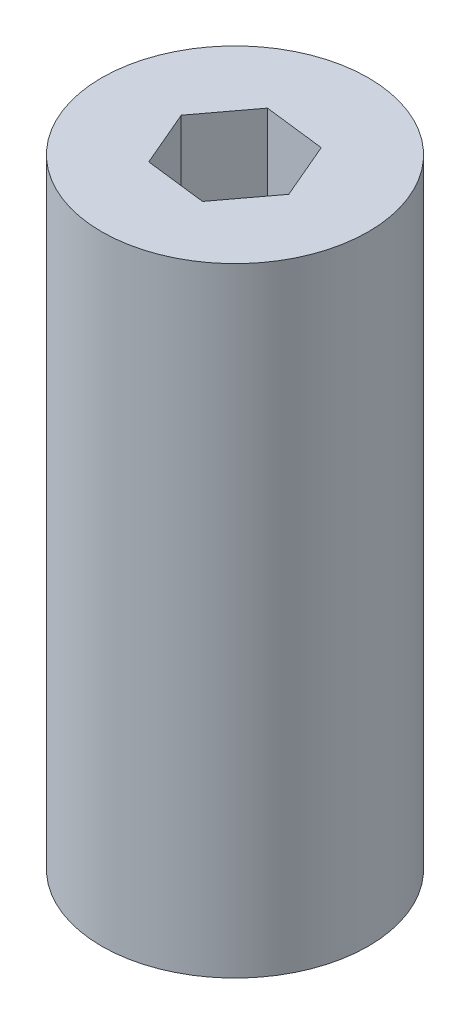
ISO-10303-21;
HEADER;
FILE_DESCRIPTION(('STEP AP214'),'2;1');
FILE_NAME('part.step','',(''),(''),'','','');
FILE_SCHEMA(('AUTOMOTIVE_DESIGN { 1 0 10303 214 1 1 1 1 }'));
ENDSEC;
DATA;
#1=APPLICATION_CONTEXT('core data for automotive mechanical design processes');
#2=APPLICATION_PROTOCOL_DEFINITION('international standard','automotive_design',2000,#1);
#3=PRODUCT_CONTEXT('',#1,'mechanical');
#4=PRODUCT('Part','Part','',(#3));
#5=PRODUCT_RELATED_PRODUCT_CATEGORY('part','',(#4));
#6=PRODUCT_DEFINITION_FORMATION('','',#4);
#7=PRODUCT_DEFINITION_CONTEXT('part definition',#1,'design');
#8=PRODUCT_DEFINITION('design','',#6,#7);
#9=PRODUCT_DEFINITION_SHAPE('','',#8);
#10=(LENGTH_UNIT() NAMED_UNIT(*) SI_UNIT(.MILLI.,.METRE.));
#11=(NAMED_UNIT(*) PLANE_ANGLE_UNIT() SI_UNIT($,.RADIAN.));
#12=(NAMED_UNIT(*) SI_UNIT($,.STERADIAN.) SOLID_ANGLE_UNIT());
#13=UNCERTAINTY_MEASURE_WITH_UNIT(LENGTH_MEASURE(1.E-05),#10,'distance_accuracy_value','');
#14=(GEOMETRIC_REPRESENTATION_CONTEXT(3) GLOBAL_UNCERTAINTY_ASSIGNED_CONTEXT((#13)) GLOBAL_UNIT_ASSIGNED_CONTEXT((#10,
#11,#12)) REPRESENTATION_CONTEXT('',''));
#15=CARTESIAN_POINT('',(0.,0.,0.));
#16=DIRECTION('',(0.,0.,1.));
#17=DIRECTION('',(1.,0.,0.));
#18=AXIS2_PLACEMENT_3D('',#15,#16,#17);
#19=CARTESIAN_POINT('',(0.,73.66,0.));
#20=DIRECTION('',(0.,1.,0.));
#21=DIRECTION('',(0.,0.,1.));
#22=AXIS2_PLACEMENT_3D('',#19,#20,#21);
#23=PLANE('',#22);
#24=CARTESIAN_POINT('',(0.,73.66,0.));
#25=DIRECTION('',(0.,1.,0.));
#26=DIRECTION('',(0.,0.,1.));
#27=AXIS2_PLACEMENT_3D('',#24,#25,#26);
#28=CIRCLE('',#27,15.875);
#29=CARTESIAN_POINT('',(0.,73.66,15.875));
#30=VERTEX_POINT('',#29);
#31=EDGE_CURVE('E11',#30,#30,#28,.T.);
#32=ORIENTED_EDGE('',*,*,#31,.T.);
#33=EDGE_LOOP('',(#32));
#34=FACE_BOUND('',#33,.T.);
#35=DIRECTION('',(-0.992820323027552,0.,-0.119615242270658));
#36=VECTOR('',#35,1.);
#37=CARTESIAN_POINT('',(4.39940905122492,73.66,-5.86587873496662));
#38=LINE('',#37,#36);
#39=CARTESIAN_POINT('',(4.39940905122492,73.66,-5.86587873496662));
#40=VERTEX_POINT('',#39);
#41=CARTESIAN_POINT('',(-2.88029547438756,73.66,-6.74293936748328));
#42=VERTEX_POINT('',#41);
#43=EDGE_CURVE('E98',#40,#42,#38,.T.);
#44=ORIENTED_EDGE('',*,*,#43,.F.);
#45=DIRECTION('',(-0.392820323027556,0.,-0.919615242270661));
#46=VECTOR('',#45,1.);
#47=CARTESIAN_POINT('',(7.27970452561248,73.66,0.87706063251666));
#48=LINE('',#47,#46);
#49=CARTESIAN_POINT('',(7.27970452561248,73.66,0.87706063251666));
#50=VERTEX_POINT('',#49);
#51=EDGE_CURVE('E90',#50,#40,#48,.T.);
#52=ORIENTED_EDGE('',*,*,#51,.F.);
#53=DIRECTION('',(0.599999999999995,0.,-0.800000000000004));
#54=VECTOR('',#53,1.);
#55=CARTESIAN_POINT('',(2.88029547438757,73.66,6.74293936748329));
#56=LINE('',#55,#54);
#57=CARTESIAN_POINT('',(2.88029547438757,73.66,6.74293936748329));
#58=VERTEX_POINT('',#57);
#59=EDGE_CURVE('E118',#58,#50,#56,.T.);
#60=ORIENTED_EDGE('',*,*,#59,.F.);
#61=DIRECTION('',(0.992820323027552,0.,0.119615242270657));
#62=VECTOR('',#61,1.);
#63=CARTESIAN_POINT('',(-4.39940905122491,73.66,5.86587873496663));
#64=LINE('',#63,#62);
#65=CARTESIAN_POINT('',(-4.39940905122491,73.66,5.86587873496663));
#66=VERTEX_POINT('',#65);
#67=EDGE_CURVE('E116',#66,#58,#64,.T.);
#68=ORIENTED_EDGE('',*,*,#67,.F.);
#69=DIRECTION('',(0.392820323027556,0.,0.919615242270661));
#70=VECTOR('',#69,1.);
#71=CARTESIAN_POINT('',(-7.27970452561248,73.66,-0.877060632516658));
#72=LINE('',#71,#70);
#73=CARTESIAN_POINT('',(-7.27970452561248,73.66,-0.877060632516658));
#74=VERTEX_POINT('',#73);
#75=EDGE_CURVE('E112',#74,#66,#72,.T.);
#76=ORIENTED_EDGE('',*,*,#75,.F.);
#77=DIRECTION('',(-0.599999999999995,0.,0.800000000000004));
#78=VECTOR('',#77,1.);
#79=CARTESIAN_POINT('',(-2.88029547438756,73.66,-6.74293936748328));
#80=LINE('',#79,#78);
#81=EDGE_CURVE('E110',#42,#74,#80,.T.);
#82=ORIENTED_EDGE('',*,*,#81,.F.);
#83=EDGE_LOOP('',(#44,#52,#60,#68,#76,#82));
#84=FACE_BOUND('',#83,.T.);
#85=ADVANCED_FACE('F37',(#34,#84),#23,.T.);
#86=CARTESIAN_POINT('',(0.,0.,0.));
#87=DIRECTION('',(0.,1.,0.));
#88=DIRECTION('',(0.,0.,1.));
#89=AXIS2_PLACEMENT_3D('',#86,#87,#88);
#90=PLANE('',#89);
#91=CARTESIAN_POINT('',(0.,0.,0.));
#92=DIRECTION('',(0.,1.,0.));
#93=DIRECTION('',(0.,0.,1.));
#94=AXIS2_PLACEMENT_3D('',#91,#92,#93);
#95=CIRCLE('',#94,15.875);
#96=CARTESIAN_POINT('',(0.,0.,15.875));
#97=VERTEX_POINT('',#96);
#98=EDGE_CURVE('E41',#97,#97,#95,.T.);
#99=ORIENTED_EDGE('',*,*,#98,.F.);
#100=EDGE_LOOP('',(#99));
#101=FACE_BOUND('',#100,.T.);
#102=DIRECTION('',(-0.392820323027556,0.,-0.919615242270661));
#103=VECTOR('',#102,1.);
#104=CARTESIAN_POINT('',(7.27970452561248,0.,0.87706063251666));
#105=LINE('',#104,#103);
#106=CARTESIAN_POINT('',(7.27970452561248,0.,0.87706063251666));
#107=VERTEX_POINT('',#106);
#108=CARTESIAN_POINT('',(4.39940905122492,0.,-5.86587873496662));
#109=VERTEX_POINT('',#108);
#110=EDGE_CURVE('E60',#107,#109,#105,.T.);
#111=ORIENTED_EDGE('',*,*,#110,.T.);
#112=DIRECTION('',(-0.992820323027552,0.,-0.119615242270658));
#113=VECTOR('',#112,1.);
#114=CARTESIAN_POINT('',(4.39940905122492,0.,-5.86587873496662));
#115=LINE('',#114,#113);
#116=CARTESIAN_POINT('',(-2.88029547438756,0.,-6.74293936748328));
#117=VERTEX_POINT('',#116);
#118=EDGE_CURVE('E105',#109,#117,#115,.T.);
#119=ORIENTED_EDGE('',*,*,#118,.T.);
#120=DIRECTION('',(-0.599999999999995,0.,0.800000000000004));
#121=VECTOR('',#120,1.);
#122=CARTESIAN_POINT('',(-2.88029547438756,0.,-6.74293936748328));
#123=LINE('',#122,#121);
#124=CARTESIAN_POINT('',(-7.27970452561248,0.,-0.877060632516658));
#125=VERTEX_POINT('',#124);
#126=EDGE_CURVE('E122',#117,#125,#123,.T.);
#127=ORIENTED_EDGE('',*,*,#126,.T.);
#128=DIRECTION('',(0.392820323027556,0.,0.919615242270661));
#129=VECTOR('',#128,1.);
#130=CARTESIAN_POINT('',(-7.27970452561248,0.,-0.877060632516658));
#131=LINE('',#130,#129);
#132=CARTESIAN_POINT('',(-4.39940905122491,0.,5.86587873496663));
#133=VERTEX_POINT('',#132);
#134=EDGE_CURVE('E125',#125,#133,#131,.T.);
#135=ORIENTED_EDGE('',*,*,#134,.T.);
#136=DIRECTION('',(0.992820323027552,0.,0.119615242270657));
#137=VECTOR('',#136,1.);
#138=CARTESIAN_POINT('',(-4.39940905122491,0.,5.86587873496663));
#139=LINE('',#138,#137);
#140=CARTESIAN_POINT('',(2.88029547438757,0.,6.74293936748329));
#141=VERTEX_POINT('',#140);
#142=EDGE_CURVE('E128',#133,#141,#139,.T.);
#143=ORIENTED_EDGE('',*,*,#142,.T.);
#144=DIRECTION('',(0.599999999999995,0.,-0.800000000000004));
#145=VECTOR('',#144,1.);
#146=CARTESIAN_POINT('',(2.88029547438757,0.,6.74293936748329));
#147=LINE('',#146,#145);
#148=EDGE_CURVE('E99',#141,#107,#147,.T.);
#149=ORIENTED_EDGE('',*,*,#148,.T.);
#150=EDGE_LOOP('',(#111,#119,#127,#135,#143,#149));
#151=FACE_BOUND('',#150,.T.);
#152=ADVANCED_FACE('F145',(#101,#151),#90,.F.);
#153=CARTESIAN_POINT('',(0.,73.66,0.));
#154=DIRECTION('',(0.,-1.,0.));
#155=DIRECTION('',(0.,0.,-1.));
#156=AXIS2_PLACEMENT_3D('',#153,#154,#155);
#157=CYLINDRICAL_SURFACE('',#156,15.875);
#158=ORIENTED_EDGE('',*,*,#31,.F.);
#159=EDGE_LOOP('',(#158));
#160=FACE_BOUND('',#159,.T.);
#161=ORIENTED_EDGE('',*,*,#98,.T.);
#162=EDGE_LOOP('',(#161));
#163=FACE_BOUND('',#162,.T.);
#164=ADVANCED_FACE('F39',(#160,#163),#157,.T.);
#165=CARTESIAN_POINT('',(7.27970452561248,73.66,0.87706063251666));
#166=DIRECTION('',(-0.919615242270661,0.,0.392820323027556));
#167=DIRECTION('',(0.392820323027556,0.,0.919615242270661));
#168=AXIS2_PLACEMENT_3D('',#165,#166,#167);
#169=PLANE('',#168);
#170=ORIENTED_EDGE('',*,*,#110,.F.);
#171=DIRECTION('',(0.,-1.,0.));
#172=VECTOR('',#171,1.);
#173=CARTESIAN_POINT('',(7.27970452561248,73.66,0.87706063251666));
#174=LINE('',#173,#172);
#175=EDGE_CURVE('E94',#50,#107,#174,.T.);
#176=ORIENTED_EDGE('',*,*,#175,.F.);
#177=ORIENTED_EDGE('',*,*,#51,.T.);
#178=DIRECTION('',(0.,-1.,0.));
#179=VECTOR('',#178,1.);
#180=CARTESIAN_POINT('',(4.39940905122492,73.66,-5.86587873496662));
#181=LINE('',#180,#179);
#182=EDGE_CURVE('E93',#40,#109,#181,.T.);
#183=ORIENTED_EDGE('',*,*,#182,.T.);
#184=EDGE_LOOP('',(#170,#176,#177,#183));
#185=FACE_BOUND('',#184,.T.);
#186=ADVANCED_FACE('F92',(#185),#169,.T.);
#187=CARTESIAN_POINT('',(4.39940905122492,73.66,-5.86587873496662));
#188=DIRECTION('',(-0.119615242270658,0.,0.992820323027552));
#189=DIRECTION('',(0.992820323027552,0.,0.119615242270658));
#190=AXIS2_PLACEMENT_3D('',#187,#188,#189);
#191=PLANE('',#190);
#192=ORIENTED_EDGE('',*,*,#118,.F.);
#193=ORIENTED_EDGE('',*,*,#182,.F.);
#194=ORIENTED_EDGE('',*,*,#43,.T.);
#195=DIRECTION('',(0.,-1.,0.));
#196=VECTOR('',#195,1.);
#197=CARTESIAN_POINT('',(-2.88029547438756,73.66,-6.74293936748328));
#198=LINE('',#197,#196);
#199=EDGE_CURVE('E106',#42,#117,#198,.T.);
#200=ORIENTED_EDGE('',*,*,#199,.T.);
#201=EDGE_LOOP('',(#192,#193,#194,#200));
#202=FACE_BOUND('',#201,.T.);
#203=ADVANCED_FACE('F102',(#202),#191,.T.);
#204=CARTESIAN_POINT('',(-2.88029547438756,73.66,-6.74293936748328));
#205=DIRECTION('',(0.800000000000004,0.,0.599999999999995));
#206=DIRECTION('',(0.599999999999995,0.,-0.800000000000004));
#207=AXIS2_PLACEMENT_3D('',#204,#205,#206);
#208=PLANE('',#207);
#209=ORIENTED_EDGE('',*,*,#126,.F.);
#210=ORIENTED_EDGE('',*,*,#199,.F.);
#211=ORIENTED_EDGE('',*,*,#81,.T.);
#212=DIRECTION('',(0.,-1.,0.));
#213=VECTOR('',#212,1.);
#214=CARTESIAN_POINT('',(-7.27970452561248,73.66,-0.877060632516658));
#215=LINE('',#214,#213);
#216=EDGE_CURVE('E137',#74,#125,#215,.T.);
#217=ORIENTED_EDGE('',*,*,#216,.T.);
#218=EDGE_LOOP('',(#209,#210,#211,#217));
#219=FACE_BOUND('',#218,.T.);
#220=ADVANCED_FACE('F141',(#219),#208,.T.);
#221=CARTESIAN_POINT('',(-7.27970452561248,73.66,-0.877060632516658));
#222=DIRECTION('',(0.919615242270661,0.,-0.392820323027556));
#223=DIRECTION('',(-0.392820323027556,0.,-0.919615242270661));
#224=AXIS2_PLACEMENT_3D('',#221,#222,#223);
#225=PLANE('',#224);
#226=ORIENTED_EDGE('',*,*,#134,.F.);
#227=ORIENTED_EDGE('',*,*,#216,.F.);
#228=ORIENTED_EDGE('',*,*,#75,.T.);
#229=DIRECTION('',(0.,-1.,0.));
#230=VECTOR('',#229,1.);
#231=CARTESIAN_POINT('',(-4.39940905122491,73.66,5.86587873496663));
#232=LINE('',#231,#230);
#233=EDGE_CURVE('E135',#66,#133,#232,.T.);
#234=ORIENTED_EDGE('',*,*,#233,.T.);
#235=EDGE_LOOP('',(#226,#227,#228,#234));
#236=FACE_BOUND('',#235,.T.);
#237=ADVANCED_FACE('F153',(#236),#225,.T.);
#238=CARTESIAN_POINT('',(-4.39940905122491,73.66,5.86587873496663));
#239=DIRECTION('',(0.119615242270657,0.,-0.992820323027552));
#240=DIRECTION('',(-0.992820323027552,0.,-0.119615242270657));
#241=AXIS2_PLACEMENT_3D('',#238,#239,#240);
#242=PLANE('',#241);
#243=ORIENTED_EDGE('',*,*,#142,.F.);
#244=ORIENTED_EDGE('',*,*,#233,.F.);
#245=ORIENTED_EDGE('',*,*,#67,.T.);
#246=DIRECTION('',(0.,-1.,0.));
#247=VECTOR('',#246,1.);
#248=CARTESIAN_POINT('',(2.88029547438757,73.66,6.74293936748329));
#249=LINE('',#248,#247);
#250=EDGE_CURVE('E52',#58,#141,#249,.T.);
#251=ORIENTED_EDGE('',*,*,#250,.T.);
#252=EDGE_LOOP('',(#243,#244,#245,#251));
#253=FACE_BOUND('',#252,.T.);
#254=ADVANCED_FACE('F151',(#253),#242,.T.);
#255=CARTESIAN_POINT('',(2.88029547438757,73.66,6.74293936748329));
#256=DIRECTION('',(-0.800000000000004,0.,-0.599999999999995));
#257=DIRECTION('',(-0.599999999999995,0.,0.800000000000004));
#258=AXIS2_PLACEMENT_3D('',#255,#256,#257);
#259=PLANE('',#258);
#260=ORIENTED_EDGE('',*,*,#148,.F.);
#261=ORIENTED_EDGE('',*,*,#250,.F.);
#262=ORIENTED_EDGE('',*,*,#59,.T.);
#263=ORIENTED_EDGE('',*,*,#175,.T.);
#264=EDGE_LOOP('',(#260,#261,#262,#263));
#265=FACE_BOUND('',#264,.T.);
#266=ADVANCED_FACE('F147',(#265),#259,.T.);
#267=CLOSED_SHELL('',(#85,#152,#164,#186,#203,#220,#237,#254,#266));
#268=MANIFOLD_SOLID_BREP('B2',#267);
#269=ADVANCED_BREP_SHAPE_REPRESENTATION('',(#18,#268),#14);
#270=SHAPE_DEFINITION_REPRESENTATION(#9,#269);
ENDSEC;
END-ISO-10303-21;
